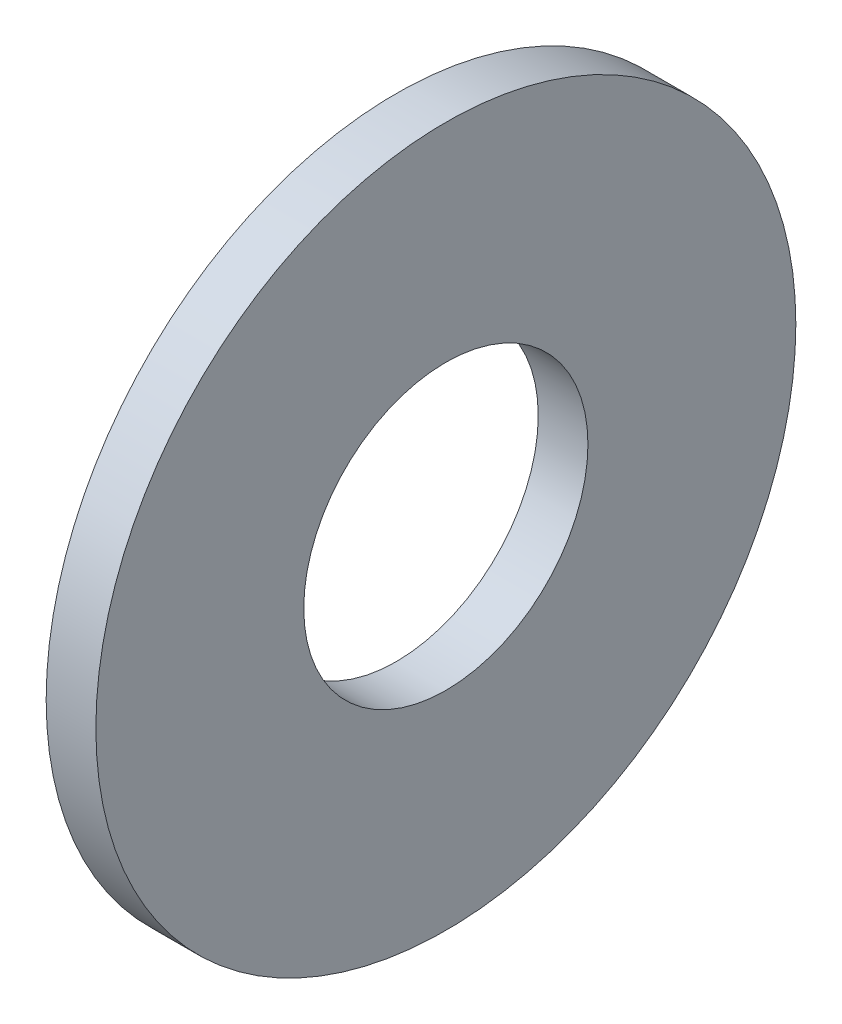
ISO-10303-21;
HEADER;
FILE_DESCRIPTION(('STEP AP214'),'2;1');
FILE_NAME('part.step','',(''),(''),'','','');
FILE_SCHEMA(('AUTOMOTIVE_DESIGN { 1 0 10303 214 1 1 1 1 }'));
ENDSEC;
DATA;
#1=APPLICATION_CONTEXT('core data for automotive mechanical design processes');
#2=APPLICATION_PROTOCOL_DEFINITION('international standard','automotive_design',2000,#1);
#3=PRODUCT_CONTEXT('',#1,'mechanical');
#4=PRODUCT('Part','Part','',(#3));
#5=PRODUCT_RELATED_PRODUCT_CATEGORY('part','',(#4));
#6=PRODUCT_DEFINITION_FORMATION('','',#4);
#7=PRODUCT_DEFINITION_CONTEXT('part definition',#1,'design');
#8=PRODUCT_DEFINITION('design','',#6,#7);
#9=PRODUCT_DEFINITION_SHAPE('','',#8);
#10=(LENGTH_UNIT() NAMED_UNIT(*) SI_UNIT(.MILLI.,.METRE.));
#11=(NAMED_UNIT(*) PLANE_ANGLE_UNIT() SI_UNIT($,.RADIAN.));
#12=(NAMED_UNIT(*) SI_UNIT($,.STERADIAN.) SOLID_ANGLE_UNIT());
#13=UNCERTAINTY_MEASURE_WITH_UNIT(LENGTH_MEASURE(1.E-05),#10,'distance_accuracy_value','');
#14=(GEOMETRIC_REPRESENTATION_CONTEXT(3) GLOBAL_UNCERTAINTY_ASSIGNED_CONTEXT((#13)) GLOBAL_UNIT_ASSIGNED_CONTEXT((#10,
#11,#12)) REPRESENTATION_CONTEXT('',''));
#15=CARTESIAN_POINT('',(0.,0.,0.));
#16=DIRECTION('',(0.,0.,1.));
#17=DIRECTION('',(1.,0.,0.));
#18=AXIS2_PLACEMENT_3D('',#15,#16,#17);
#19=CARTESIAN_POINT('',(1.8034,0.,0.));
#20=DIRECTION('',(1.,0.,0.));
#21=DIRECTION('',(0.,0.,-1.));
#22=AXIS2_PLACEMENT_3D('',#19,#20,#21);
#23=PLANE('',#22);
#24=CARTESIAN_POINT('',(1.8034,0.,0.));
#25=DIRECTION('',(1.,0.,0.));
#26=DIRECTION('',(0.,0.,-1.));
#27=AXIS2_PLACEMENT_3D('',#24,#25,#26);
#28=CIRCLE('',#27,12.7);
#29=CARTESIAN_POINT('',(1.8034,0.,-12.7));
#30=VERTEX_POINT('',#29);
#31=EDGE_CURVE('E10',#30,#30,#28,.T.);
#32=ORIENTED_EDGE('',*,*,#31,.T.);
#33=EDGE_LOOP('',(#32));
#34=FACE_BOUND('',#33,.T.);
#35=CARTESIAN_POINT('',(1.8034,0.,0.));
#36=DIRECTION('',(1.,0.,0.));
#37=DIRECTION('',(0.,0.,-1.));
#38=AXIS2_PLACEMENT_3D('',#35,#36,#37);
#39=CIRCLE('',#38,5.1562);
#40=CARTESIAN_POINT('',(1.8034,0.,-5.1562));
#41=VERTEX_POINT('',#40);
#42=EDGE_CURVE('E46',#41,#41,#39,.T.);
#43=ORIENTED_EDGE('',*,*,#42,.F.);
#44=EDGE_LOOP('',(#43));
#45=FACE_BOUND('',#44,.T.);
#46=ADVANCED_FACE('F35',(#34,#45),#23,.T.);
#47=CARTESIAN_POINT('',(0.,0.,0.));
#48=DIRECTION('',(1.,0.,0.));
#49=DIRECTION('',(0.,0.,-1.));
#50=AXIS2_PLACEMENT_3D('',#47,#48,#49);
#51=PLANE('',#50);
#52=CARTESIAN_POINT('',(0.,0.,0.));
#53=DIRECTION('',(1.,0.,0.));
#54=DIRECTION('',(0.,0.,-1.));
#55=AXIS2_PLACEMENT_3D('',#52,#53,#54);
#56=CIRCLE('',#55,12.7);
#57=CARTESIAN_POINT('',(0.,0.,-12.7));
#58=VERTEX_POINT('',#57);
#59=EDGE_CURVE('E39',#58,#58,#56,.T.);
#60=ORIENTED_EDGE('',*,*,#59,.F.);
#61=EDGE_LOOP('',(#60));
#62=FACE_BOUND('',#61,.T.);
#63=CARTESIAN_POINT('',(0.,0.,0.));
#64=DIRECTION('',(1.,0.,0.));
#65=DIRECTION('',(0.,0.,-1.));
#66=AXIS2_PLACEMENT_3D('',#63,#64,#65);
#67=CIRCLE('',#66,5.1562);
#68=CARTESIAN_POINT('',(0.,0.,-5.1562));
#69=VERTEX_POINT('',#68);
#70=EDGE_CURVE('E48',#69,#69,#67,.T.);
#71=ORIENTED_EDGE('',*,*,#70,.T.);
#72=EDGE_LOOP('',(#71));
#73=FACE_BOUND('',#72,.T.);
#74=ADVANCED_FACE('F58',(#62,#73),#51,.F.);
#75=CARTESIAN_POINT('',(1.8034,0.,0.));
#76=DIRECTION('',(-1.,0.,0.));
#77=DIRECTION('',(0.,0.,1.));
#78=AXIS2_PLACEMENT_3D('',#75,#76,#77);
#79=CYLINDRICAL_SURFACE('',#78,12.7);
#80=ORIENTED_EDGE('',*,*,#31,.F.);
#81=EDGE_LOOP('',(#80));
#82=FACE_BOUND('',#81,.T.);
#83=ORIENTED_EDGE('',*,*,#59,.T.);
#84=EDGE_LOOP('',(#83));
#85=FACE_BOUND('',#84,.T.);
#86=ADVANCED_FACE('F37',(#82,#85),#79,.T.);
#87=CARTESIAN_POINT('',(1.8034,0.,0.));
#88=DIRECTION('',(-1.,0.,0.));
#89=DIRECTION('',(0.,0.,1.));
#90=AXIS2_PLACEMENT_3D('',#87,#88,#89);
#91=CYLINDRICAL_SURFACE('',#90,5.1562);
#92=ORIENTED_EDGE('',*,*,#42,.T.);
#93=EDGE_LOOP('',(#92));
#94=FACE_BOUND('',#93,.T.);
#95=ORIENTED_EDGE('',*,*,#70,.F.);
#96=EDGE_LOOP('',(#95));
#97=FACE_BOUND('',#96,.T.);
#98=ADVANCED_FACE('F54',(#94,#97),#91,.F.);
#99=CLOSED_SHELL('',(#46,#74,#86,#98));
#100=MANIFOLD_SOLID_BREP('B2',#99);
#101=ADVANCED_BREP_SHAPE_REPRESENTATION('',(#18,#100),#14);
#102=SHAPE_DEFINITION_REPRESENTATION(#9,#101);
ENDSEC;
END-ISO-10303-21;
